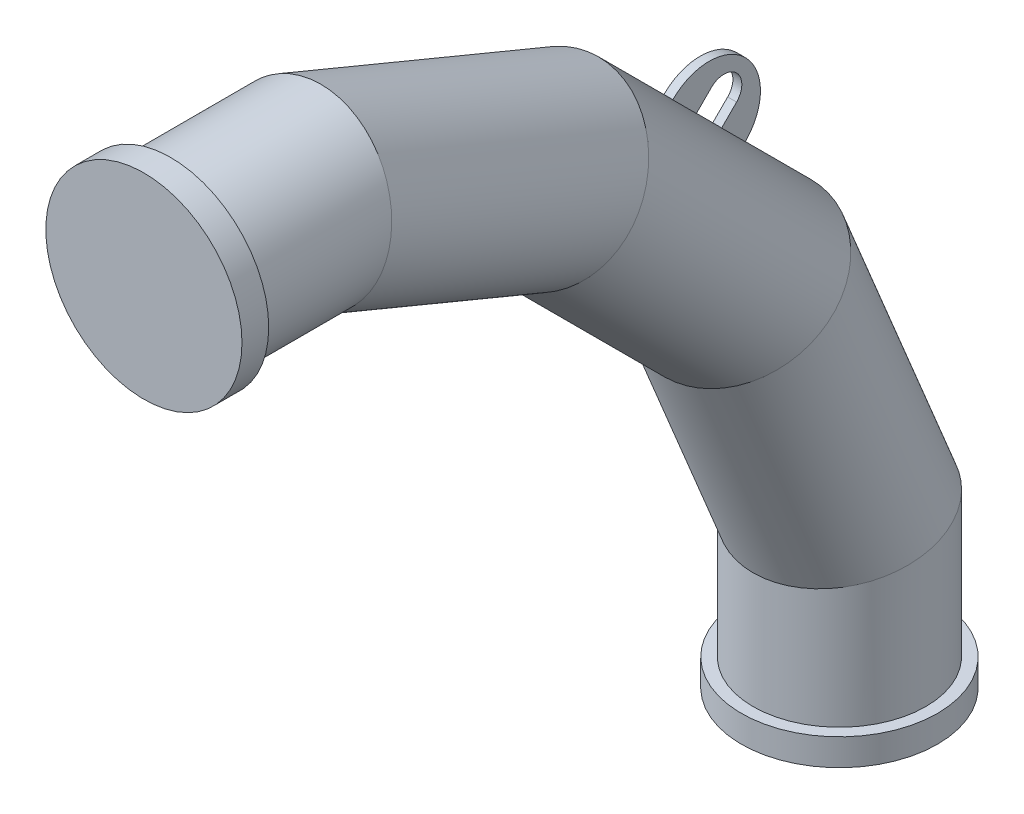
ISO-10303-21;
HEADER;
FILE_DESCRIPTION(('STEP AP214'),'2;1');
FILE_NAME('part.step','',(''),(''),'','','');
FILE_SCHEMA(('AUTOMOTIVE_DESIGN { 1 0 10303 214 1 1 1 1 }'));
ENDSEC;
DATA;
#1=APPLICATION_CONTEXT('core data for automotive mechanical design processes');
#2=APPLICATION_PROTOCOL_DEFINITION('international standard','automotive_design',2000,#1);
#3=PRODUCT_CONTEXT('',#1,'mechanical');
#4=PRODUCT('Part','Part','',(#3));
#5=PRODUCT_RELATED_PRODUCT_CATEGORY('part','',(#4));
#6=PRODUCT_DEFINITION_FORMATION('','',#4);
#7=PRODUCT_DEFINITION_CONTEXT('part definition',#1,'design');
#8=PRODUCT_DEFINITION('design','',#6,#7);
#9=PRODUCT_DEFINITION_SHAPE('','',#8);
#10=(LENGTH_UNIT() NAMED_UNIT(*) SI_UNIT(.MILLI.,.METRE.));
#11=(NAMED_UNIT(*) PLANE_ANGLE_UNIT() SI_UNIT($,.RADIAN.));
#12=(NAMED_UNIT(*) SI_UNIT($,.STERADIAN.) SOLID_ANGLE_UNIT());
#13=UNCERTAINTY_MEASURE_WITH_UNIT(LENGTH_MEASURE(1.E-05),#10,'distance_accuracy_value','');
#14=(GEOMETRIC_REPRESENTATION_CONTEXT(3) GLOBAL_UNCERTAINTY_ASSIGNED_CONTEXT((#13)) GLOBAL_UNIT_ASSIGNED_CONTEXT((#10,
#11,#12)) REPRESENTATION_CONTEXT('',''));
#15=CARTESIAN_POINT('',(0.,0.,0.));
#16=DIRECTION('',(0.,0.,1.));
#17=DIRECTION('',(1.,0.,0.));
#18=AXIS2_PLACEMENT_3D('',#15,#16,#17);
#19=CARTESIAN_POINT('',(0.,0.,0.));
#20=DIRECTION('',(0.,0.,1.));
#21=DIRECTION('',(1.,0.,0.));
#22=AXIS2_PLACEMENT_3D('',#19,#20,#21);
#23=PLANE('',#22);
#24=CARTESIAN_POINT('',(0.,0.,0.));
#25=DIRECTION('',(0.,0.,1.));
#26=DIRECTION('',(1.,0.,0.));
#27=AXIS2_PLACEMENT_3D('',#24,#25,#26);
#28=CIRCLE('',#27,110.);
#29=CARTESIAN_POINT('',(110.,0.,0.));
#30=VERTEX_POINT('',#29);
#31=EDGE_CURVE('E20',#30,#30,#28,.T.);
#32=ORIENTED_EDGE('',*,*,#31,.T.);
#33=EDGE_LOOP('',(#32));
#34=FACE_BOUND('',#33,.T.);
#35=ADVANCED_FACE('F16',(#34),#23,.T.);
#36=CARTESIAN_POINT('',(0.,0.,-30.));
#37=DIRECTION('',(0.,0.,1.));
#38=DIRECTION('',(1.,0.,0.));
#39=AXIS2_PLACEMENT_3D('',#36,#37,#38);
#40=CYLINDRICAL_SURFACE('',#39,110.);
#41=CARTESIAN_POINT('',(0.,0.,-30.));
#42=DIRECTION('',(0.,0.,1.));
#43=DIRECTION('',(1.,0.,0.));
#44=AXIS2_PLACEMENT_3D('',#41,#42,#43);
#45=CIRCLE('',#44,110.);
#46=CARTESIAN_POINT('',(110.,0.,-30.));
#47=VERTEX_POINT('',#46);
#48=EDGE_CURVE('E26',#47,#47,#45,.T.);
#49=ORIENTED_EDGE('',*,*,#48,.T.);
#50=EDGE_LOOP('',(#49));
#51=FACE_BOUND('',#50,.T.);
#52=ORIENTED_EDGE('',*,*,#31,.F.);
#53=EDGE_LOOP('',(#52));
#54=FACE_BOUND('',#53,.T.);
#55=ADVANCED_FACE('F18',(#51,#54),#40,.T.);
#56=CARTESIAN_POINT('',(0.,0.,-30.));
#57=DIRECTION('',(0.,0.,1.));
#58=DIRECTION('',(1.,0.,0.));
#59=AXIS2_PLACEMENT_3D('',#56,#57,#58);
#60=PLANE('',#59);
#61=CARTESIAN_POINT('',(0.,0.,-30.));
#62=DIRECTION('',(0.,0.,-1.));
#63=DIRECTION('',(-1.00000000000001,0.,0.));
#64=AXIS2_PLACEMENT_3D('',#61,#62,#63);
#65=CIRCLE('',#64,96.85);
#66=CARTESIAN_POINT('',(-96.8500000000006,0.,-30.));
#67=VERTEX_POINT('',#66);
#68=EDGE_CURVE('E10',#67,#67,#65,.T.);
#69=ORIENTED_EDGE('',*,*,#68,.F.);
#70=EDGE_LOOP('',(#69));
#71=FACE_BOUND('',#70,.T.);
#72=ORIENTED_EDGE('',*,*,#48,.F.);
#73=EDGE_LOOP('',(#72));
#74=FACE_BOUND('',#73,.T.);
#75=ADVANCED_FACE('F207',(#71,#74),#60,.F.);
#76=CARTESIAN_POINT('',(0.,-325.159126987109,-665.81929876693));
#77=DIRECTION('',(0.,0.707106781186547,0.707106781186548));
#78=DIRECTION('',(0.,-0.707106781186548,0.707106781186547));
#79=AXIS2_PLACEMENT_3D('',#76,#77,#78);
#80=CYLINDRICAL_SURFACE('',#79,96.85);
#81=CARTESIAN_POINT('',(0.,-233.812049733821,-574.472221513642));
#82=DIRECTION('',(0.,-0.707106781186548,-0.707106781186549));
#83=DIRECTION('',(0.,0.707106781186548,-0.707106781186547));
#84=AXIS2_PLACEMENT_3D('',#81,#82,#83);
#85=CIRCLE('',#84,96.85);
#86=CARTESIAN_POINT('',(-4.99999999999998,-165.420082003684,-642.864189243778));
#87=VERTEX_POINT('',#86);
#88=CARTESIAN_POINT('',(5.00000000000002,-165.420082003684,-642.864189243778));
#89=VERTEX_POINT('',#88);
#90=EDGE_CURVE('E186',#87,#89,#85,.T.);
#91=ORIENTED_EDGE('',*,*,#90,.F.);
#92=DIRECTION('',(0.,0.707106781186547,0.707106781186548));
#93=VECTOR('',#92,1.);
#94=CARTESIAN_POINT('',(-5.,-256.767159256973,-734.211266497066));
#95=LINE('',#94,#93);
#96=CARTESIAN_POINT('',(-5.,-191.93658629818,-669.380693538273));
#97=VERTEX_POINT('',#96);
#98=EDGE_CURVE('E180',#97,#87,#95,.T.);
#99=ORIENTED_EDGE('',*,*,#98,.F.);
#100=CARTESIAN_POINT('',(0.,-260.328554028316,-600.988725808137));
#101=DIRECTION('',(0.,0.707106781186548,0.707106781186548));
#102=DIRECTION('',(0.,-0.707106781186548,0.707106781186548));
#103=AXIS2_PLACEMENT_3D('',#100,#101,#102);
#104=CIRCLE('',#103,96.85);
#105=CARTESIAN_POINT('',(5.00000000000001,-191.93658629818,-669.380693538273));
#106=VERTEX_POINT('',#105);
#107=EDGE_CURVE('E110',#106,#97,#104,.T.);
#108=ORIENTED_EDGE('',*,*,#107,.F.);
#109=DIRECTION('',(0.,0.707106781186547,0.707106781186548));
#110=VECTOR('',#109,1.);
#111=CARTESIAN_POINT('',(5.00000000000001,-256.767159256973,-734.211266497066));
#112=LINE('',#111,#110);
#113=EDGE_CURVE('E183',#106,#89,#112,.T.);
#114=ORIENTED_EDGE('',*,*,#113,.T.);
#115=EDGE_LOOP('',(#91,#99,#108,#114));
#116=FACE_BOUND('',#115,.T.);
#117=CARTESIAN_POINT('',(0.,-325.159126987111,-665.819298766929));
#118=DIRECTION('',(0.,0.831469612302548,0.555570233019599));
#119=DIRECTION('',(0.,-0.555570233019599,0.831469612302548));
#120=AXIS2_PLACEMENT_3D('',#117,#118,#119);
#121=ELLIPSE('',#120,98.7474036724756,96.85);
#122=CARTESIAN_POINT('',(1.59289000727829E-13,-380.020245055509,-583.713833319493));
#123=VERTEX_POINT('',#122);
#124=EDGE_CURVE('E167',#123,#123,#121,.T.);
#125=ORIENTED_EDGE('',*,*,#124,.T.);
#126=EDGE_LOOP('',(#125));
#127=FACE_BOUND('',#126,.T.);
#128=CARTESIAN_POINT('',(0.,-114.18070123307,-454.840873012891));
#129=DIRECTION('',(0.,0.555570233019602,0.831469612302545));
#130=DIRECTION('',(0.,0.831469612302545,-0.555570233019602));
#131=AXIS2_PLACEMENT_3D('',#128,#129,#130);
#132=ELLIPSE('',#131,98.7474036724756,96.85);
#133=CARTESIAN_POINT('',(0.,-32.0752357856334,-509.701991081289));
#134=VERTEX_POINT('',#133);
#135=EDGE_CURVE('E163',#134,#134,#132,.T.);
#136=ORIENTED_EDGE('',*,*,#135,.F.);
#137=EDGE_LOOP('',(#136));
#138=FACE_BOUND('',#137,.T.);
#139=CARTESIAN_POINT('',(0.,-205.527778486359,-546.18795026618));
#140=DIRECTION('',(0.,0.707106781186549,0.707106781186549));
#141=DIRECTION('',(0.,-0.707106781186548,0.707106781186547));
#142=AXIS2_PLACEMENT_3D('',#139,#140,#141);
#143=CIRCLE('',#142,96.85);
#144=CARTESIAN_POINT('',(5.00000000000003,-137.135810756222,-614.579917996316));
#145=VERTEX_POINT('',#144);
#146=CARTESIAN_POINT('',(-4.99999999999998,-137.135810756222,-614.579917996316));
#147=VERTEX_POINT('',#146);
#148=EDGE_CURVE('E39',#145,#147,#143,.T.);
#149=ORIENTED_EDGE('',*,*,#148,.F.);
#150=CARTESIAN_POINT('',(5.00000000000001,-110.619306461727,-588.06341370182));
#151=VERTEX_POINT('',#150);
#152=EDGE_CURVE('E187',#145,#151,#112,.T.);
#153=ORIENTED_EDGE('',*,*,#152,.T.);
#154=CARTESIAN_POINT('',(0.,-179.011274191863,-519.671445971684));
#155=DIRECTION('',(0.,-0.707106781186548,-0.707106781186548));
#156=DIRECTION('',(0.,0.707106781186548,-0.707106781186548));
#157=AXIS2_PLACEMENT_3D('',#154,#155,#156);
#158=CIRCLE('',#157,96.85);
#159=CARTESIAN_POINT('',(-5.,-110.619306461727,-588.06341370182));
#160=VERTEX_POINT('',#159);
#161=EDGE_CURVE('E191',#160,#151,#158,.T.);
#162=ORIENTED_EDGE('',*,*,#161,.F.);
#163=EDGE_CURVE('E48',#147,#160,#95,.T.);
#164=ORIENTED_EDGE('',*,*,#163,.F.);
#165=EDGE_LOOP('',(#149,#153,#162,#164));
#166=FACE_BOUND('',#165,.T.);
#167=ADVANCED_FACE('F214',(#116,#127,#138,#166),#80,.T.);
#168=CARTESIAN_POINT('',(0.,-750.000000000003,-779.999999999997));
#169=DIRECTION('',(0.,-1.,0.));
#170=DIRECTION('',(1.,0.,0.));
#171=AXIS2_PLACEMENT_3D('',#168,#169,#170);
#172=CYLINDRICAL_SURFACE('',#171,110.);
#173=CARTESIAN_POINT('',(0.,-750.000000000003,-779.999999999997));
#174=DIRECTION('',(0.,-1.,0.));
#175=DIRECTION('',(1.,0.,0.));
#176=AXIS2_PLACEMENT_3D('',#173,#174,#175);
#177=CIRCLE('',#176,110.);
#178=CARTESIAN_POINT('',(110.,-750.000000000003,-779.999999999997));
#179=VERTEX_POINT('',#178);
#180=EDGE_CURVE('E151',#179,#179,#177,.T.);
#181=ORIENTED_EDGE('',*,*,#180,.T.);
#182=EDGE_LOOP('',(#181));
#183=FACE_BOUND('',#182,.T.);
#184=CARTESIAN_POINT('',(0.,-780.000000000003,-779.999999999997));
#185=DIRECTION('',(0.,-1.,0.));
#186=DIRECTION('',(1.,0.,0.));
#187=AXIS2_PLACEMENT_3D('',#184,#185,#186);
#188=CIRCLE('',#187,110.);
#189=CARTESIAN_POINT('',(110.,-780.000000000003,-779.999999999997));
#190=VERTEX_POINT('',#189);
#191=EDGE_CURVE('E150',#190,#190,#188,.T.);
#192=ORIENTED_EDGE('',*,*,#191,.F.);
#193=EDGE_LOOP('',(#192));
#194=FACE_BOUND('',#193,.T.);
#195=ADVANCED_FACE('F236',(#183,#194),#172,.T.);
#196=CARTESIAN_POINT('',(0.,-750.000000000003,-779.999999999997));
#197=DIRECTION('',(0.,-1.,0.));
#198=DIRECTION('',(1.,0.,0.));
#199=AXIS2_PLACEMENT_3D('',#196,#197,#198);
#200=PLANE('',#199);
#201=CARTESIAN_POINT('',(0.,-750.000000000003,-779.999999999997));
#202=DIRECTION('',(0.,1.,0.));
#203=DIRECTION('',(1.00000000000001,0.,0.));
#204=AXIS2_PLACEMENT_3D('',#201,#202,#203);
#205=CIRCLE('',#204,96.85);
#206=CARTESIAN_POINT('',(96.8500000000007,-750.000000000003,-779.999999999997));
#207=VERTEX_POINT('',#206);
#208=EDGE_CURVE('E155',#207,#207,#205,.T.);
#209=ORIENTED_EDGE('',*,*,#208,.F.);
#210=EDGE_LOOP('',(#209));
#211=FACE_BOUND('',#210,.T.);
#212=ORIENTED_EDGE('',*,*,#180,.F.);
#213=EDGE_LOOP('',(#212));
#214=FACE_BOUND('',#213,.T.);
#215=ADVANCED_FACE('F228',(#211,#214),#200,.F.);
#216=CARTESIAN_POINT('',(0.,-600.81572446526,-779.999999999998));
#217=DIRECTION('',(0.,-1.,0.));
#218=DIRECTION('',(-1.00000000000001,0.,0.));
#219=AXIS2_PLACEMENT_3D('',#216,#217,#218);
#220=CYLINDRICAL_SURFACE('',#219,96.85);
#221=ORIENTED_EDGE('',*,*,#208,.T.);
#222=EDGE_LOOP('',(#221));
#223=FACE_BOUND('',#222,.T.);
#224=CARTESIAN_POINT('',(0.,-600.81572446526,-779.999999999998));
#225=DIRECTION('',(0.,0.980785280403231,0.195090322016124));
#226=DIRECTION('',(0.,-0.195090322016124,0.980785280403231));
#227=AXIS2_PLACEMENT_3D('',#224,#225,#226);
#228=ELLIPSE('',#227,98.7474036724756,96.85);
#229=CARTESIAN_POINT('',(1.05044286481272E-13,-620.080387245979,-683.149999999998));
#230=VERTEX_POINT('',#229);
#231=EDGE_CURVE('E171',#230,#230,#228,.T.);
#232=ORIENTED_EDGE('',*,*,#231,.F.);
#233=EDGE_LOOP('',(#232));
#234=FACE_BOUND('',#233,.T.);
#235=ADVANCED_FACE('F224',(#223,#234),#220,.T.);
#236=CARTESIAN_POINT('',(0.,-325.159126987111,-665.819298766929));
#237=DIRECTION('',(0.,-0.923879532511289,-0.382683432365085));
#238=DIRECTION('',(0.,-0.382683432365085,0.923879532511289));
#239=AXIS2_PLACEMENT_3D('',#236,#237,#238);
#240=CYLINDRICAL_SURFACE('',#239,96.85);
#241=ORIENTED_EDGE('',*,*,#124,.F.);
#242=EDGE_LOOP('',(#241));
#243=FACE_BOUND('',#242,.T.);
#244=ORIENTED_EDGE('',*,*,#231,.T.);
#245=EDGE_LOOP('',(#244));
#246=FACE_BOUND('',#245,.T.);
#247=ADVANCED_FACE('F227',(#243,#246),#240,.T.);
#248=CARTESIAN_POINT('',(0.,-114.18070123307,-454.840873012891));
#249=DIRECTION('',(0.,0.382683432365089,0.923879532511287));
#250=DIRECTION('',(0.,-0.923879532511287,0.382683432365089));
#251=AXIS2_PLACEMENT_3D('',#248,#249,#250);
#252=CYLINDRICAL_SURFACE('',#251,96.85);
#253=ORIENTED_EDGE('',*,*,#135,.T.);
#254=EDGE_LOOP('',(#253));
#255=FACE_BOUND('',#254,.T.);
#256=CARTESIAN_POINT('',(0.,0.,-179.184275534743));
#257=DIRECTION('',(0.,0.195090322016128,0.98078528040323));
#258=DIRECTION('',(0.,0.980785280403231,-0.195090322016128));
#259=AXIS2_PLACEMENT_3D('',#256,#257,#258);
#260=ELLIPSE('',#259,98.7474036724756,96.85);
#261=CARTESIAN_POINT('',(0.,96.85,-198.448938315463));
#262=VERTEX_POINT('',#261);
#263=EDGE_CURVE('E159',#262,#262,#260,.T.);
#264=ORIENTED_EDGE('',*,*,#263,.F.);
#265=EDGE_LOOP('',(#264));
#266=FACE_BOUND('',#265,.T.);
#267=ADVANCED_FACE('F232',(#255,#266),#252,.T.);
#268=CARTESIAN_POINT('',(0.,0.,-179.184275534743));
#269=DIRECTION('',(0.,0.,1.));
#270=DIRECTION('',(1.00000000000001,0.,0.));
#271=AXIS2_PLACEMENT_3D('',#268,#269,#270);
#272=CYLINDRICAL_SURFACE('',#271,96.85);
#273=ORIENTED_EDGE('',*,*,#68,.T.);
#274=EDGE_LOOP('',(#273));
#275=FACE_BOUND('',#274,.T.);
#276=ORIENTED_EDGE('',*,*,#263,.T.);
#277=EDGE_LOOP('',(#276));
#278=FACE_BOUND('',#277,.T.);
#279=ADVANCED_FACE('F240',(#275,#278),#272,.T.);
#280=CARTESIAN_POINT('',(5.00000000000001,-134.46354697711,-645.53645302289));
#281=DIRECTION('',(1.,0.,0.));
#282=DIRECTION('',(0.,0.707106781186549,-0.707106781186548));
#283=AXIS2_PLACEMENT_3D('',#280,#281,#282);
#284=PLANE('',#283);
#285=ORIENTED_EDGE('',*,*,#113,.F.);
#286=DIRECTION('',(0.,0.707106781186548,-0.707106781186548));
#287=VECTOR('',#286,1.);
#288=CARTESIAN_POINT('',(5.00000000000001,-198.810264065086,-662.507015771367));
#289=LINE('',#288,#287);
#290=CARTESIAN_POINT('',(5.00000000000001,-191.739196253221,-669.578083583232));
#291=VERTEX_POINT('',#290);
#292=EDGE_CURVE('E115',#106,#291,#289,.T.);
#293=ORIENTED_EDGE('',*,*,#292,.T.);
#294=CARTESIAN_POINT('',(5.00000000000001,-151.080556334994,-628.919443665006));
#295=DIRECTION('',(1.,0.,0.));
#296=DIRECTION('',(0.,0.707106781186549,-0.707106781186548));
#297=AXIS2_PLACEMENT_3D('',#294,#295,#296);
#298=CIRCLE('',#297,57.5);
#299=CARTESIAN_POINT('',(5.00000000000001,-110.421916416768,-588.260803746779));
#300=VERTEX_POINT('',#299);
#301=EDGE_CURVE('E132',#291,#300,#298,.T.);
#302=ORIENTED_EDGE('',*,*,#301,.T.);
#303=DIRECTION('',(0.,0.707106781186548,-0.707106781186548));
#304=VECTOR('',#303,1.);
#305=CARTESIAN_POINT('',(5.00000000000001,-117.492984228633,-581.189735934914));
#306=LINE('',#305,#304);
#307=EDGE_CURVE('E114',#151,#300,#306,.T.);
#308=ORIENTED_EDGE('',*,*,#307,.F.);
#309=ORIENTED_EDGE('',*,*,#152,.F.);
#310=DIRECTION('',(0.,0.707106781186549,-0.707106781186549));
#311=VECTOR('',#310,1.);
#312=CARTESIAN_POINT('',(5.00000000000001,-136.938420711263,-614.777308041275));
#313=LINE('',#312,#311);
#314=CARTESIAN_POINT('',(5.00000000000001,-120.321411353379,-631.394317399159));
#315=VERTEX_POINT('',#314);
#316=EDGE_CURVE('E126',#145,#315,#313,.T.);
#317=ORIENTED_EDGE('',*,*,#316,.T.);
#318=CARTESIAN_POINT('',(5.00000000000001,-134.46354697711,-645.53645302289));
#319=DIRECTION('',(-1.,0.,0.));
#320=DIRECTION('',(0.,0.707106781186549,-0.707106781186548));
#321=AXIS2_PLACEMENT_3D('',#318,#319,#320);
#322=CIRCLE('',#321,20.);
#323=CARTESIAN_POINT('',(5.00000000000001,-148.605682600841,-659.67858864662));
#324=VERTEX_POINT('',#323);
#325=EDGE_CURVE('E605',#315,#324,#322,.T.);
#326=ORIENTED_EDGE('',*,*,#325,.T.);
#327=DIRECTION('',(0.,-0.707106781186549,0.707106781186548));
#328=VECTOR('',#327,1.);
#329=CARTESIAN_POINT('',(5.00000000000001,-165.222691958725,-643.061579288737));
#330=LINE('',#329,#328);
#331=EDGE_CURVE('E608',#324,#89,#330,.T.);
#332=ORIENTED_EDGE('',*,*,#331,.T.);
#333=EDGE_LOOP('',(#285,#293,#302,#308,#309,#317,#326,#332));
#334=FACE_BOUND('',#333,.T.);
#335=ADVANCED_FACE('F244',(#334),#284,.T.);
#336=CARTESIAN_POINT('',(-5.,-134.46354697711,-645.53645302289));
#337=DIRECTION('',(1.,0.,0.));
#338=DIRECTION('',(0.,0.707106781186549,-0.707106781186548));
#339=AXIS2_PLACEMENT_3D('',#336,#337,#338);
#340=PLANE('',#339);
#341=DIRECTION('',(0.,0.707106781186548,-0.707106781186548));
#342=VECTOR('',#341,1.);
#343=CARTESIAN_POINT('',(-5.,-198.810264065086,-662.507015771367));
#344=LINE('',#343,#342);
#345=CARTESIAN_POINT('',(-5.,-191.739196253221,-669.578083583232));
#346=VERTEX_POINT('',#345);
#347=EDGE_CURVE('E104',#97,#346,#344,.T.);
#348=ORIENTED_EDGE('',*,*,#347,.F.);
#349=ORIENTED_EDGE('',*,*,#98,.T.);
#350=DIRECTION('',(0.,-0.707106781186549,0.707106781186548));
#351=VECTOR('',#350,1.);
#352=CARTESIAN_POINT('',(-5.,-165.222691958725,-643.061579288737));
#353=LINE('',#352,#351);
#354=CARTESIAN_POINT('',(-5.,-148.605682600841,-659.67858864662));
#355=VERTEX_POINT('',#354);
#356=EDGE_CURVE('E127',#355,#87,#353,.T.);
#357=ORIENTED_EDGE('',*,*,#356,.F.);
#358=CARTESIAN_POINT('',(-5.,-134.46354697711,-645.53645302289));
#359=DIRECTION('',(-1.,0.,0.));
#360=DIRECTION('',(0.,0.707106781186549,-0.707106781186548));
#361=AXIS2_PLACEMENT_3D('',#358,#359,#360);
#362=CIRCLE('',#361,20.);
#363=CARTESIAN_POINT('',(-5.,-120.321411353379,-631.394317399159));
#364=VERTEX_POINT('',#363);
#365=EDGE_CURVE('E598',#364,#355,#362,.T.);
#366=ORIENTED_EDGE('',*,*,#365,.F.);
#367=DIRECTION('',(0.,0.707106781186549,-0.707106781186549));
#368=VECTOR('',#367,1.);
#369=CARTESIAN_POINT('',(-5.,-136.938420711263,-614.777308041275));
#370=LINE('',#369,#368);
#371=EDGE_CURVE('E593',#147,#364,#370,.T.);
#372=ORIENTED_EDGE('',*,*,#371,.F.);
#373=ORIENTED_EDGE('',*,*,#163,.T.);
#374=DIRECTION('',(0.,0.707106781186548,-0.707106781186548));
#375=VECTOR('',#374,1.);
#376=CARTESIAN_POINT('',(-5.,-117.492984228633,-581.189735934914));
#377=LINE('',#376,#375);
#378=CARTESIAN_POINT('',(-5.,-110.421916416768,-588.260803746779));
#379=VERTEX_POINT('',#378);
#380=EDGE_CURVE('E121',#160,#379,#377,.T.);
#381=ORIENTED_EDGE('',*,*,#380,.T.);
#382=CARTESIAN_POINT('',(-5.,-151.080556334994,-628.919443665006));
#383=DIRECTION('',(1.,0.,0.));
#384=DIRECTION('',(0.,0.707106781186549,-0.707106781186548));
#385=AXIS2_PLACEMENT_3D('',#382,#383,#384);
#386=CIRCLE('',#385,57.5);
#387=EDGE_CURVE('E118',#346,#379,#386,.T.);
#388=ORIENTED_EDGE('',*,*,#387,.F.);
#389=EDGE_LOOP('',(#348,#349,#357,#366,#372,#373,#381,#388));
#390=FACE_BOUND('',#389,.T.);
#391=ADVANCED_FACE('F119',(#390),#340,.F.);
#392=CARTESIAN_POINT('',(5.00000000000001,-136.938420711263,-614.777308041275));
#393=DIRECTION('',(0.,0.707106781186549,0.707106781186549));
#394=DIRECTION('',(0.,-0.707106781186549,0.707106781186549));
#395=AXIS2_PLACEMENT_3D('',#392,#393,#394);
#396=PLANE('',#395);
#397=ORIENTED_EDGE('',*,*,#316,.F.);
#398=ORIENTED_EDGE('',*,*,#148,.T.);
#399=ORIENTED_EDGE('',*,*,#371,.T.);
#400=DIRECTION('',(-1.,0.,0.));
#401=VECTOR('',#400,1.);
#402=CARTESIAN_POINT('',(5.00000000000001,-120.321411353379,-631.394317399159));
#403=LINE('',#402,#401);
#404=EDGE_CURVE('E142',#315,#364,#403,.T.);
#405=ORIENTED_EDGE('',*,*,#404,.F.);
#406=EDGE_LOOP('',(#397,#398,#399,#405));
#407=FACE_BOUND('',#406,.T.);
#408=ADVANCED_FACE('F255',(#407),#396,.F.);
#409=CARTESIAN_POINT('',(5.00000000000001,-134.46354697711,-645.53645302289));
#410=DIRECTION('',(-1.,0.,0.));
#411=DIRECTION('',(0.,-0.707106781186549,0.707106781186548));
#412=AXIS2_PLACEMENT_3D('',#409,#410,#411);
#413=CYLINDRICAL_SURFACE('',#412,20.);
#414=ORIENTED_EDGE('',*,*,#365,.T.);
#415=DIRECTION('',(-1.,0.,0.));
#416=VECTOR('',#415,1.);
#417=CARTESIAN_POINT('',(5.00000000000001,-148.605682600841,-659.67858864662));
#418=LINE('',#417,#416);
#419=EDGE_CURVE('E134',#324,#355,#418,.T.);
#420=ORIENTED_EDGE('',*,*,#419,.F.);
#421=ORIENTED_EDGE('',*,*,#325,.F.);
#422=ORIENTED_EDGE('',*,*,#404,.T.);
#423=EDGE_LOOP('',(#414,#420,#421,#422));
#424=FACE_BOUND('',#423,.T.);
#425=ADVANCED_FACE('F258',(#424),#413,.F.);
#426=CARTESIAN_POINT('',(5.00000000000001,-165.222691958725,-643.061579288737));
#427=DIRECTION('',(0.,-0.707106781186548,-0.707106781186549));
#428=DIRECTION('',(0.,0.707106781186549,-0.707106781186548));
#429=AXIS2_PLACEMENT_3D('',#426,#427,#428);
#430=PLANE('',#429);
#431=ORIENTED_EDGE('',*,*,#356,.T.);
#432=ORIENTED_EDGE('',*,*,#90,.T.);
#433=ORIENTED_EDGE('',*,*,#331,.F.);
#434=ORIENTED_EDGE('',*,*,#419,.T.);
#435=EDGE_LOOP('',(#431,#432,#433,#434));
#436=FACE_BOUND('',#435,.T.);
#437=ADVANCED_FACE('F262',(#436),#430,.F.);
#438=CARTESIAN_POINT('',(5.00000000000001,-151.080556334994,-628.919443665006));
#439=DIRECTION('',(-1.,0.,0.));
#440=DIRECTION('',(0.,-0.707106781186549,0.707106781186548));
#441=AXIS2_PLACEMENT_3D('',#438,#439,#440);
#442=CYLINDRICAL_SURFACE('',#441,57.5);
#443=ORIENTED_EDGE('',*,*,#387,.T.);
#444=DIRECTION('',(-1.,0.,0.));
#445=VECTOR('',#444,1.);
#446=CARTESIAN_POINT('',(5.00000000000001,-110.421916416768,-588.260803746779));
#447=LINE('',#446,#445);
#448=EDGE_CURVE('E135',#300,#379,#447,.T.);
#449=ORIENTED_EDGE('',*,*,#448,.F.);
#450=ORIENTED_EDGE('',*,*,#301,.F.);
#451=DIRECTION('',(-1.,0.,0.));
#452=VECTOR('',#451,1.);
#453=CARTESIAN_POINT('',(5.00000000000001,-191.739196253221,-669.578083583232));
#454=LINE('',#453,#452);
#455=EDGE_CURVE('E109',#291,#346,#454,.T.);
#456=ORIENTED_EDGE('',*,*,#455,.T.);
#457=EDGE_LOOP('',(#443,#449,#450,#456));
#458=FACE_BOUND('',#457,.T.);
#459=ADVANCED_FACE('F130',(#458),#442,.T.);
#460=CARTESIAN_POINT('',(5.00000000000001,-117.492984228633,-581.189735934914));
#461=DIRECTION('',(0.,-0.707106781186548,-0.707106781186548));
#462=DIRECTION('',(0.,0.707106781186548,-0.707106781186548));
#463=AXIS2_PLACEMENT_3D('',#460,#461,#462);
#464=PLANE('',#463);
#465=ORIENTED_EDGE('',*,*,#380,.F.);
#466=ORIENTED_EDGE('',*,*,#161,.T.);
#467=ORIENTED_EDGE('',*,*,#307,.T.);
#468=ORIENTED_EDGE('',*,*,#448,.T.);
#469=EDGE_LOOP('',(#465,#466,#467,#468));
#470=FACE_BOUND('',#469,.T.);
#471=ADVANCED_FACE('F269',(#470),#464,.F.);
#472=CARTESIAN_POINT('',(-5.,-198.810264065086,-662.507015771367));
#473=DIRECTION('',(0.,0.707106781186548,0.707106781186548));
#474=DIRECTION('',(0.,-0.707106781186548,0.707106781186548));
#475=AXIS2_PLACEMENT_3D('',#472,#473,#474);
#476=PLANE('',#475);
#477=ORIENTED_EDGE('',*,*,#292,.F.);
#478=ORIENTED_EDGE('',*,*,#107,.T.);
#479=ORIENTED_EDGE('',*,*,#347,.T.);
#480=ORIENTED_EDGE('',*,*,#455,.F.);
#481=EDGE_LOOP('',(#477,#478,#479,#480));
#482=FACE_BOUND('',#481,.T.);
#483=ADVANCED_FACE('F107',(#482),#476,.F.);
#484=CARTESIAN_POINT('',(0.,-780.000000000003,-779.999999999997));
#485=DIRECTION('',(0.,-1.,0.));
#486=DIRECTION('',(1.,0.,0.));
#487=AXIS2_PLACEMENT_3D('',#484,#485,#486);
#488=PLANE('',#487);
#489=ORIENTED_EDGE('',*,*,#191,.T.);
#490=EDGE_LOOP('',(#489));
#491=FACE_BOUND('',#490,.T.);
#492=ADVANCED_FACE('F249',(#491),#488,.T.);
#493=CLOSED_SHELL('',(#35,#55,#75,#167,#195,#215,#235,#247,#267,#279,#335,#391,#408,#425,#437,
#459,#471,#483,#492));
#494=MANIFOLD_SOLID_BREP('B1',#493);
#495=ADVANCED_BREP_SHAPE_REPRESENTATION('',(#18,#494),#14);
#496=SHAPE_DEFINITION_REPRESENTATION(#9,#495);
ENDSEC;
END-ISO-10303-21;
